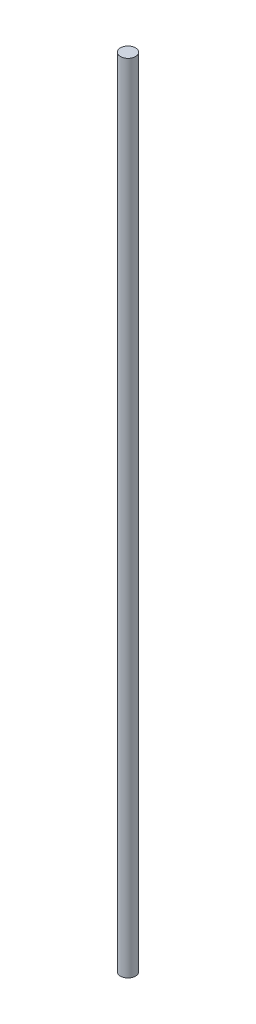
ISO-10303-21;
HEADER;
FILE_DESCRIPTION(('STEP AP214'),'2;1');
FILE_NAME('part.step','',(''),(''),'','','');
FILE_SCHEMA(('AUTOMOTIVE_DESIGN { 1 0 10303 214 1 1 1 1 }'));
ENDSEC;
DATA;
#1=APPLICATION_CONTEXT('core data for automotive mechanical design processes');
#2=APPLICATION_PROTOCOL_DEFINITION('international standard','automotive_design',2000,#1);
#3=PRODUCT_CONTEXT('',#1,'mechanical');
#4=PRODUCT('Part','Part','',(#3));
#5=PRODUCT_RELATED_PRODUCT_CATEGORY('part','',(#4));
#6=PRODUCT_DEFINITION_FORMATION('','',#4);
#7=PRODUCT_DEFINITION_CONTEXT('part definition',#1,'design');
#8=PRODUCT_DEFINITION('design','',#6,#7);
#9=PRODUCT_DEFINITION_SHAPE('','',#8);
#10=(LENGTH_UNIT() NAMED_UNIT(*) SI_UNIT(.MILLI.,.METRE.));
#11=(NAMED_UNIT(*) PLANE_ANGLE_UNIT() SI_UNIT($,.RADIAN.));
#12=(NAMED_UNIT(*) SI_UNIT($,.STERADIAN.) SOLID_ANGLE_UNIT());
#13=UNCERTAINTY_MEASURE_WITH_UNIT(LENGTH_MEASURE(1.E-05),#10,'distance_accuracy_value','');
#14=(GEOMETRIC_REPRESENTATION_CONTEXT(3) GLOBAL_UNCERTAINTY_ASSIGNED_CONTEXT((#13)) GLOBAL_UNIT_ASSIGNED_CONTEXT((#10,
#11,#12)) REPRESENTATION_CONTEXT('',''));
#15=CARTESIAN_POINT('',(0.,0.,0.));
#16=DIRECTION('',(0.,0.,1.));
#17=DIRECTION('',(1.,0.,0.));
#18=AXIS2_PLACEMENT_3D('',#15,#16,#17);
#19=CARTESIAN_POINT('',(0.,100.,0.));
#20=DIRECTION('',(0.,-1.,0.));
#21=DIRECTION('',(0.,0.,-1.));
#22=AXIS2_PLACEMENT_3D('',#19,#20,#21);
#23=CYLINDRICAL_SURFACE('',#22,0.95);
#24=CARTESIAN_POINT('',(0.,100.,0.));
#25=DIRECTION('',(0.,1.,0.));
#26=DIRECTION('',(0.,0.,1.));
#27=AXIS2_PLACEMENT_3D('',#24,#25,#26);
#28=CIRCLE('',#27,0.95);
#29=CARTESIAN_POINT('',(0.,100.,0.95));
#30=VERTEX_POINT('',#29);
#31=EDGE_CURVE('E10',#30,#30,#28,.T.);
#32=ORIENTED_EDGE('',*,*,#31,.F.);
#33=EDGE_LOOP('',(#32));
#34=FACE_BOUND('',#33,.T.);
#35=CARTESIAN_POINT('',(0.,0.,0.));
#36=DIRECTION('',(0.,1.,0.));
#37=DIRECTION('',(0.,0.,1.));
#38=AXIS2_PLACEMENT_3D('',#35,#36,#37);
#39=CIRCLE('',#38,0.95);
#40=CARTESIAN_POINT('',(0.,0.,0.95));
#41=VERTEX_POINT('',#40);
#42=EDGE_CURVE('E34',#41,#41,#39,.T.);
#43=ORIENTED_EDGE('',*,*,#42,.T.);
#44=EDGE_LOOP('',(#43));
#45=FACE_BOUND('',#44,.T.);
#46=ADVANCED_FACE('F31',(#34,#45),#23,.T.);
#47=CARTESIAN_POINT('',(0.,100.,0.));
#48=DIRECTION('',(0.,1.,0.));
#49=DIRECTION('',(0.,0.,1.));
#50=AXIS2_PLACEMENT_3D('',#47,#48,#49);
#51=PLANE('',#50);
#52=ORIENTED_EDGE('',*,*,#31,.T.);
#53=EDGE_LOOP('',(#52));
#54=FACE_BOUND('',#53,.T.);
#55=ADVANCED_FACE('F46',(#54),#51,.T.);
#56=CARTESIAN_POINT('',(0.,0.,0.));
#57=DIRECTION('',(0.,1.,0.));
#58=DIRECTION('',(0.,0.,1.));
#59=AXIS2_PLACEMENT_3D('',#56,#57,#58);
#60=PLANE('',#59);
#61=ORIENTED_EDGE('',*,*,#42,.F.);
#62=EDGE_LOOP('',(#61));
#63=FACE_BOUND('',#62,.T.);
#64=ADVANCED_FACE('F44',(#63),#60,.F.);
#65=CLOSED_SHELL('',(#46,#55,#64));
#66=MANIFOLD_SOLID_BREP('B2',#65);
#67=ADVANCED_BREP_SHAPE_REPRESENTATION('',(#18,#66),#14);
#68=SHAPE_DEFINITION_REPRESENTATION(#9,#67);
ENDSEC;
END-ISO-10303-21;
